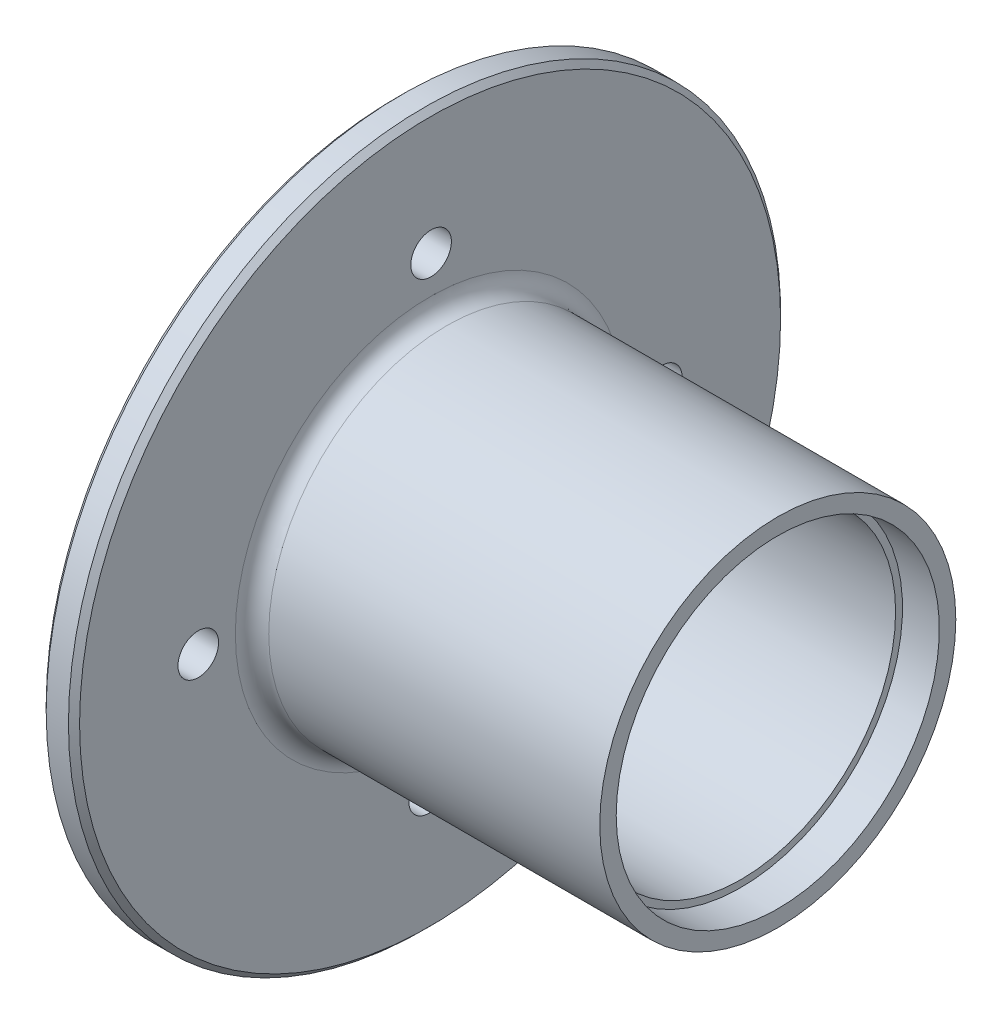
ISO-10303-21;
HEADER;
FILE_DESCRIPTION(('STEP AP214'),'2;1');
FILE_NAME('part.step','',(''),(''),'','','');
FILE_SCHEMA(('AUTOMOTIVE_DESIGN { 1 0 10303 214 1 1 1 1 }'));
ENDSEC;
DATA;
#1=APPLICATION_CONTEXT('core data for automotive mechanical design processes');
#2=APPLICATION_PROTOCOL_DEFINITION('international standard','automotive_design',2000,#1);
#3=PRODUCT_CONTEXT('',#1,'mechanical');
#4=PRODUCT('Part','Part','',(#3));
#5=PRODUCT_RELATED_PRODUCT_CATEGORY('part','',(#4));
#6=PRODUCT_DEFINITION_FORMATION('','',#4);
#7=PRODUCT_DEFINITION_CONTEXT('part definition',#1,'design');
#8=PRODUCT_DEFINITION('design','',#6,#7);
#9=PRODUCT_DEFINITION_SHAPE('','',#8);
#10=(LENGTH_UNIT() NAMED_UNIT(*) SI_UNIT(.MILLI.,.METRE.));
#11=(NAMED_UNIT(*) PLANE_ANGLE_UNIT() SI_UNIT($,.RADIAN.));
#12=(NAMED_UNIT(*) SI_UNIT($,.STERADIAN.) SOLID_ANGLE_UNIT());
#13=UNCERTAINTY_MEASURE_WITH_UNIT(LENGTH_MEASURE(1.E-05),#10,'distance_accuracy_value','');
#14=(GEOMETRIC_REPRESENTATION_CONTEXT(3) GLOBAL_UNCERTAINTY_ASSIGNED_CONTEXT((#13)) GLOBAL_UNIT_ASSIGNED_CONTEXT((#10,
#11,#12)) REPRESENTATION_CONTEXT('',''));
#15=CARTESIAN_POINT('',(0.,0.,0.));
#16=DIRECTION('',(0.,0.,1.));
#17=DIRECTION('',(1.,0.,0.));
#18=AXIS2_PLACEMENT_3D('',#15,#16,#17);
#19=CARTESIAN_POINT('',(0.,0.,0.));
#20=DIRECTION('',(-1.,0.,0.));
#21=DIRECTION('',(0.,0.,1.));
#22=AXIS2_PLACEMENT_3D('',#19,#20,#21);
#23=CONICAL_SURFACE('',#22,17.143351135521,0.767642261232655);
#24=CARTESIAN_POINT('',(4.7625,0.,0.));
#25=DIRECTION('',(-1.,0.,0.));
#26=DIRECTION('',(0.,0.,1.));
#27=AXIS2_PLACEMENT_3D('',#24,#25,#26);
#28=CIRCLE('',#27,12.5470426882416);
#29=CARTESIAN_POINT('',(4.7625,0.,12.5470426882416));
#30=VERTEX_POINT('',#29);
#31=EDGE_CURVE('E10',#30,#30,#28,.T.);
#32=ORIENTED_EDGE('',*,*,#31,.F.);
#33=EDGE_LOOP('',(#32));
#34=FACE_BOUND('',#33,.T.);
#35=CARTESIAN_POINT('',(0.,0.,0.));
#36=DIRECTION('',(-1.,0.,0.));
#37=DIRECTION('',(0.,0.,1.));
#38=AXIS2_PLACEMENT_3D('',#35,#36,#37);
#39=CIRCLE('',#38,17.143351135521);
#40=CARTESIAN_POINT('',(0.,0.,17.143351135521));
#41=VERTEX_POINT('',#40);
#42=EDGE_CURVE('E87',#41,#41,#39,.T.);
#43=ORIENTED_EDGE('',*,*,#42,.T.);
#44=EDGE_LOOP('',(#43));
#45=FACE_BOUND('',#44,.T.);
#46=ADVANCED_FACE('F38',(#34,#45),#23,.F.);
#47=CARTESIAN_POINT('',(4.7625,12.5470426882416,0.));
#48=DIRECTION('',(-1.,0.,0.));
#49=DIRECTION('',(0.,0.,1.));
#50=AXIS2_PLACEMENT_3D('',#47,#48,#49);
#51=PLANE('',#50);
#52=CARTESIAN_POINT('',(4.7625,0.,0.));
#53=DIRECTION('',(-1.,0.,0.));
#54=DIRECTION('',(0.,0.,1.));
#55=AXIS2_PLACEMENT_3D('',#52,#53,#54);
#56=CIRCLE('',#55,17.143351135521);
#57=CARTESIAN_POINT('',(4.7625,0.,17.143351135521));
#58=VERTEX_POINT('',#57);
#59=EDGE_CURVE('E44',#58,#58,#56,.T.);
#60=ORIENTED_EDGE('',*,*,#59,.F.);
#61=EDGE_LOOP('',(#60));
#62=FACE_BOUND('',#61,.T.);
#63=ORIENTED_EDGE('',*,*,#31,.T.);
#64=EDGE_LOOP('',(#63));
#65=FACE_BOUND('',#64,.T.);
#66=ADVANCED_FACE('F202',(#62,#65),#51,.F.);
#67=CARTESIAN_POINT('',(207.498884421243,0.,0.));
#68=DIRECTION('',(-1.,0.,0.));
#69=DIRECTION('',(0.,0.,1.));
#70=AXIS2_PLACEMENT_3D('',#67,#68,#69);
#71=CYLINDRICAL_SURFACE('',#70,17.143351135521);
#72=CARTESIAN_POINT('',(20.2028356501082,0.,0.));
#73=DIRECTION('',(-1.,0.,0.));
#74=DIRECTION('',(0.,0.,1.));
#75=AXIS2_PLACEMENT_3D('',#72,#73,#74);
#76=CIRCLE('',#75,17.143351135521);
#77=CARTESIAN_POINT('',(20.2028356501082,0.,17.143351135521));
#78=VERTEX_POINT('',#77);
#79=EDGE_CURVE('E48',#78,#78,#76,.T.);
#80=ORIENTED_EDGE('',*,*,#79,.F.);
#81=EDGE_LOOP('',(#80));
#82=FACE_BOUND('',#81,.T.);
#83=ORIENTED_EDGE('',*,*,#59,.T.);
#84=EDGE_LOOP('',(#83));
#85=FACE_BOUND('',#84,.T.);
#86=ADVANCED_FACE('F197',(#82,#85),#71,.F.);
#87=CARTESIAN_POINT('',(20.2028356501082,17.143351135521,0.));
#88=DIRECTION('',(-1.,0.,0.));
#89=DIRECTION('',(0.,0.,1.));
#90=AXIS2_PLACEMENT_3D('',#87,#88,#89);
#91=PLANE('',#90);
#92=CARTESIAN_POINT('',(20.2028356501082,0.,0.));
#93=DIRECTION('',(-1.,0.,0.));
#94=DIRECTION('',(0.,0.,1.));
#95=AXIS2_PLACEMENT_3D('',#92,#93,#94);
#96=CIRCLE('',#95,22.067968077904);
#97=CARTESIAN_POINT('',(20.2028356501082,0.,22.067968077904));
#98=VERTEX_POINT('',#97);
#99=EDGE_CURVE('E52',#98,#98,#96,.T.);
#100=ORIENTED_EDGE('',*,*,#99,.F.);
#101=EDGE_LOOP('',(#100));
#102=FACE_BOUND('',#101,.T.);
#103=ORIENTED_EDGE('',*,*,#79,.T.);
#104=EDGE_LOOP('',(#103));
#105=FACE_BOUND('',#104,.T.);
#106=ADVANCED_FACE('F191',(#102,#105),#91,.F.);
#107=CARTESIAN_POINT('',(207.498884421243,0.,0.));
#108=DIRECTION('',(-1.,0.,0.));
#109=DIRECTION('',(0.,0.,1.));
#110=AXIS2_PLACEMENT_3D('',#107,#108,#109);
#111=CYLINDRICAL_SURFACE('',#110,22.067968077904);
#112=CARTESIAN_POINT('',(49.1123998924168,0.,0.));
#113=DIRECTION('',(-1.,0.,0.));
#114=DIRECTION('',(0.,0.,1.));
#115=AXIS2_PLACEMENT_3D('',#112,#113,#114);
#116=CIRCLE('',#115,22.067968077904);
#117=CARTESIAN_POINT('',(49.1123998924168,0.,22.067968077904));
#118=VERTEX_POINT('',#117);
#119=EDGE_CURVE('E57',#118,#118,#116,.T.);
#120=ORIENTED_EDGE('',*,*,#119,.F.);
#121=EDGE_LOOP('',(#120));
#122=FACE_BOUND('',#121,.T.);
#123=ORIENTED_EDGE('',*,*,#99,.T.);
#124=EDGE_LOOP('',(#123));
#125=FACE_BOUND('',#124,.T.);
#126=ADVANCED_FACE('F185',(#122,#125),#111,.F.);
#127=CARTESIAN_POINT('',(49.1123998924168,22.067968077904,0.));
#128=DIRECTION('',(-1.,0.,0.));
#129=DIRECTION('',(0.,0.,1.));
#130=AXIS2_PLACEMENT_3D('',#127,#128,#129);
#131=PLANE('',#130);
#132=CARTESIAN_POINT('',(49.1123998924168,0.,0.));
#133=DIRECTION('',(-1.,0.,0.));
#134=DIRECTION('',(0.,0.,1.));
#135=AXIS2_PLACEMENT_3D('',#132,#133,#134);
#136=CIRCLE('',#135,23.0528912698023);
#137=CARTESIAN_POINT('',(49.1123998924168,0.,23.0528912698023));
#138=VERTEX_POINT('',#137);
#139=EDGE_CURVE('E60',#138,#138,#136,.T.);
#140=ORIENTED_EDGE('',*,*,#139,.F.);
#141=EDGE_LOOP('',(#140));
#142=FACE_BOUND('',#141,.T.);
#143=ORIENTED_EDGE('',*,*,#119,.T.);
#144=EDGE_LOOP('',(#143));
#145=FACE_BOUND('',#144,.T.);
#146=ADVANCED_FACE('F179',(#142,#145),#131,.F.);
#147=CARTESIAN_POINT('',(207.498884421243,0.,0.));
#148=DIRECTION('',(-1.,0.,0.));
#149=DIRECTION('',(0.,0.,1.));
#150=AXIS2_PLACEMENT_3D('',#147,#148,#149);
#151=CYLINDRICAL_SURFACE('',#150,23.0528912698023);
#152=CARTESIAN_POINT('',(54.3686846813072,0.,0.));
#153=DIRECTION('',(-1.,0.,0.));
#154=DIRECTION('',(0.,0.,1.));
#155=AXIS2_PLACEMENT_3D('',#152,#153,#154);
#156=CIRCLE('',#155,23.0528912698023);
#157=CARTESIAN_POINT('',(54.3686846813072,0.,23.0528912698023));
#158=VERTEX_POINT('',#157);
#159=EDGE_CURVE('E63',#158,#158,#156,.T.);
#160=ORIENTED_EDGE('',*,*,#159,.F.);
#161=EDGE_LOOP('',(#160));
#162=FACE_BOUND('',#161,.T.);
#163=ORIENTED_EDGE('',*,*,#139,.T.);
#164=EDGE_LOOP('',(#163));
#165=FACE_BOUND('',#164,.T.);
#166=ADVANCED_FACE('F173',(#162,#165),#151,.F.);
#167=CARTESIAN_POINT('',(54.3686846813072,23.0528912698023,0.));
#168=DIRECTION('',(-1.,0.,0.));
#169=DIRECTION('',(0.,0.,1.));
#170=AXIS2_PLACEMENT_3D('',#167,#168,#169);
#171=PLANE('',#170);
#172=CARTESIAN_POINT('',(54.3686846813072,0.,0.));
#173=DIRECTION('',(-1.,0.,0.));
#174=DIRECTION('',(0.,0.,1.));
#175=AXIS2_PLACEMENT_3D('',#172,#173,#174);
#176=CIRCLE('',#175,25.4);
#177=CARTESIAN_POINT('',(54.3686846813072,0.,25.4));
#178=VERTEX_POINT('',#177);
#179=EDGE_CURVE('E66',#178,#178,#176,.T.);
#180=ORIENTED_EDGE('',*,*,#179,.F.);
#181=EDGE_LOOP('',(#180));
#182=FACE_BOUND('',#181,.T.);
#183=ORIENTED_EDGE('',*,*,#159,.T.);
#184=EDGE_LOOP('',(#183));
#185=FACE_BOUND('',#184,.T.);
#186=ADVANCED_FACE('F167',(#182,#185),#171,.F.);
#187=CARTESIAN_POINT('',(207.498884421243,0.,0.));
#188=DIRECTION('',(-1.,0.,0.));
#189=DIRECTION('',(0.,0.,1.));
#190=AXIS2_PLACEMENT_3D('',#187,#188,#189);
#191=CYLINDRICAL_SURFACE('',#190,25.3999999999999);
#192=CARTESIAN_POINT('',(7.14375,0.,0.));
#193=DIRECTION('',(-1.,0.,0.));
#194=DIRECTION('',(0.,0.,1.));
#195=AXIS2_PLACEMENT_3D('',#192,#193,#194);
#196=CIRCLE('',#195,25.3999999999999);
#197=CARTESIAN_POINT('',(7.14375,0.,25.3999999999999));
#198=VERTEX_POINT('',#197);
#199=EDGE_CURVE('E69',#198,#198,#196,.T.);
#200=ORIENTED_EDGE('',*,*,#199,.F.);
#201=EDGE_LOOP('',(#200));
#202=FACE_BOUND('',#201,.T.);
#203=ORIENTED_EDGE('',*,*,#179,.T.);
#204=EDGE_LOOP('',(#203));
#205=FACE_BOUND('',#204,.T.);
#206=ADVANCED_FACE('F161',(#202,#205),#191,.T.);
#207=CARTESIAN_POINT('',(7.14375,0.,0.));
#208=DIRECTION('',(-1.,0.,0.));
#209=DIRECTION('',(0.,0.,1.));
#210=AXIS2_PLACEMENT_3D('',#207,#208,#209);
#211=TOROIDAL_SURFACE('',#210,27.7812499999999,2.38125);
#212=CARTESIAN_POINT('',(4.7625,0.,0.));
#213=DIRECTION('',(-1.,0.,0.));
#214=DIRECTION('',(0.,0.,1.));
#215=AXIS2_PLACEMENT_3D('',#212,#213,#214);
#216=CIRCLE('',#215,27.7812499999999);
#217=CARTESIAN_POINT('',(4.7625,0.,27.7812499999999));
#218=VERTEX_POINT('',#217);
#219=EDGE_CURVE('E72',#218,#218,#216,.T.);
#220=ORIENTED_EDGE('',*,*,#219,.F.);
#221=EDGE_LOOP('',(#220));
#222=FACE_BOUND('',#221,.T.);
#223=ORIENTED_EDGE('',*,*,#199,.T.);
#224=EDGE_LOOP('',(#223));
#225=FACE_BOUND('',#224,.T.);
#226=ADVANCED_FACE('F154',(#222,#225),#211,.F.);
#227=CARTESIAN_POINT('',(4.7625,27.7812499999999,0.));
#228=DIRECTION('',(-1.,0.,0.));
#229=DIRECTION('',(0.,0.,1.));
#230=AXIS2_PLACEMENT_3D('',#227,#228,#229);
#231=PLANE('',#230);
#232=CARTESIAN_POINT('',(4.7625,0.14697334332829,33.069002248787));
#233=DIRECTION('',(-1.,0.,0.));
#234=DIRECTION('',(0.,0.,1.));
#235=AXIS2_PLACEMENT_3D('',#232,#233,#234);
#236=CIRCLE('',#235,2.89559999999999);
#237=CARTESIAN_POINT('',(4.7625,0.14697334332829,35.964602248787));
#238=VERTEX_POINT('',#237);
#239=EDGE_CURVE('E108',#238,#238,#236,.T.);
#240=ORIENTED_EDGE('',*,*,#239,.T.);
#241=EDGE_LOOP('',(#240));
#242=FACE_BOUND('',#241,.T.);
#243=CARTESIAN_POINT('',(4.7625,-33.069002248787,0.146973343328175));
#244=DIRECTION('',(-1.,0.,0.));
#245=DIRECTION('',(0.,0.,1.));
#246=AXIS2_PLACEMENT_3D('',#243,#244,#245);
#247=CIRCLE('',#246,2.89559999999999);
#248=CARTESIAN_POINT('',(4.7625,-33.069002248787,3.04257334332816));
#249=VERTEX_POINT('',#248);
#250=EDGE_CURVE('E102',#249,#249,#247,.T.);
#251=ORIENTED_EDGE('',*,*,#250,.T.);
#252=EDGE_LOOP('',(#251));
#253=FACE_BOUND('',#252,.T.);
#254=CARTESIAN_POINT('',(4.7625,-0.14697334332806,-33.069002248787));
#255=DIRECTION('',(-1.,0.,0.));
#256=DIRECTION('',(0.,0.,1.));
#257=AXIS2_PLACEMENT_3D('',#254,#255,#256);
#258=CIRCLE('',#257,2.89559999999999);
#259=CARTESIAN_POINT('',(4.7625,-0.14697334332806,-30.173402248787));
#260=VERTEX_POINT('',#259);
#261=EDGE_CURVE('E96',#260,#260,#258,.T.);
#262=ORIENTED_EDGE('',*,*,#261,.T.);
#263=EDGE_LOOP('',(#262));
#264=FACE_BOUND('',#263,.T.);
#265=CARTESIAN_POINT('',(4.7625,33.069002248787,-0.146973343327944));
#266=DIRECTION('',(-1.,0.,0.));
#267=DIRECTION('',(0.,0.,1.));
#268=AXIS2_PLACEMENT_3D('',#265,#266,#267);
#269=CIRCLE('',#268,2.89559999999999);
#270=CARTESIAN_POINT('',(4.7625,33.069002248787,2.74862665667205));
#271=VERTEX_POINT('',#270);
#272=EDGE_CURVE('E90',#271,#271,#269,.T.);
#273=ORIENTED_EDGE('',*,*,#272,.T.);
#274=EDGE_LOOP('',(#273));
#275=FACE_BOUND('',#274,.T.);
#276=CARTESIAN_POINT('',(4.7625,0.,0.));
#277=DIRECTION('',(-1.,0.,0.));
#278=DIRECTION('',(0.,0.,1.));
#279=AXIS2_PLACEMENT_3D('',#276,#277,#278);
#280=CIRCLE('',#279,50.00625);
#281=CARTESIAN_POINT('',(4.7625,0.,50.00625));
#282=VERTEX_POINT('',#281);
#283=EDGE_CURVE('E75',#282,#282,#280,.T.);
#284=ORIENTED_EDGE('',*,*,#283,.F.);
#285=EDGE_LOOP('',(#284));
#286=FACE_BOUND('',#285,.T.);
#287=ORIENTED_EDGE('',*,*,#219,.T.);
#288=EDGE_LOOP('',(#287));
#289=FACE_BOUND('',#288,.T.);
#290=ADVANCED_FACE('F148',(#242,#253,#264,#275,#286,#289),#231,.F.);
#291=CARTESIAN_POINT('',(4.7625,0.,0.));
#292=DIRECTION('',(-1.,0.,0.));
#293=DIRECTION('',(0.,0.,1.));
#294=AXIS2_PLACEMENT_3D('',#291,#292,#293);
#295=CONICAL_SURFACE('',#294,50.00625,0.785398163397431);
#296=CARTESIAN_POINT('',(3.96874999999999,0.,0.));
#297=DIRECTION('',(-1.,0.,0.));
#298=DIRECTION('',(0.,0.,1.));
#299=AXIS2_PLACEMENT_3D('',#296,#297,#298);
#300=CIRCLE('',#299,50.8);
#301=CARTESIAN_POINT('',(3.96874999999999,0.,50.8));
#302=VERTEX_POINT('',#301);
#303=EDGE_CURVE('E78',#302,#302,#300,.T.);
#304=ORIENTED_EDGE('',*,*,#303,.F.);
#305=EDGE_LOOP('',(#304));
#306=FACE_BOUND('',#305,.T.);
#307=ORIENTED_EDGE('',*,*,#283,.T.);
#308=EDGE_LOOP('',(#307));
#309=FACE_BOUND('',#308,.T.);
#310=ADVANCED_FACE('F142',(#306,#309),#295,.T.);
#311=CARTESIAN_POINT('',(207.498884421243,0.,0.));
#312=DIRECTION('',(-1.,0.,0.));
#313=DIRECTION('',(0.,0.,1.));
#314=AXIS2_PLACEMENT_3D('',#311,#312,#313);
#315=CYLINDRICAL_SURFACE('',#314,50.8);
#316=CARTESIAN_POINT('',(0.79375000000001,0.,0.));
#317=DIRECTION('',(-1.,0.,0.));
#318=DIRECTION('',(0.,0.,1.));
#319=AXIS2_PLACEMENT_3D('',#316,#317,#318);
#320=CIRCLE('',#319,50.8);
#321=CARTESIAN_POINT('',(0.79375000000001,0.,50.8));
#322=VERTEX_POINT('',#321);
#323=EDGE_CURVE('E81',#322,#322,#320,.T.);
#324=ORIENTED_EDGE('',*,*,#323,.F.);
#325=EDGE_LOOP('',(#324));
#326=FACE_BOUND('',#325,.T.);
#327=ORIENTED_EDGE('',*,*,#303,.T.);
#328=EDGE_LOOP('',(#327));
#329=FACE_BOUND('',#328,.T.);
#330=ADVANCED_FACE('F136',(#326,#329),#315,.T.);
#331=CARTESIAN_POINT('',(0.79375000000001,0.,0.));
#332=DIRECTION('',(1.,0.,0.));
#333=DIRECTION('',(0.,0.,-1.));
#334=AXIS2_PLACEMENT_3D('',#331,#332,#333);
#335=CONICAL_SURFACE('',#334,50.8,0.785398163397431);
#336=CARTESIAN_POINT('',(0.,0.,0.));
#337=DIRECTION('',(-1.,0.,0.));
#338=DIRECTION('',(0.,0.,1.));
#339=AXIS2_PLACEMENT_3D('',#336,#337,#338);
#340=CIRCLE('',#339,50.00625);
#341=CARTESIAN_POINT('',(0.,0.,50.00625));
#342=VERTEX_POINT('',#341);
#343=EDGE_CURVE('E84',#342,#342,#340,.T.);
#344=ORIENTED_EDGE('',*,*,#343,.F.);
#345=EDGE_LOOP('',(#344));
#346=FACE_BOUND('',#345,.T.);
#347=ORIENTED_EDGE('',*,*,#323,.T.);
#348=EDGE_LOOP('',(#347));
#349=FACE_BOUND('',#348,.T.);
#350=ADVANCED_FACE('F122',(#346,#349),#335,.T.);
#351=CARTESIAN_POINT('',(0.,50.00625,0.));
#352=DIRECTION('',(1.,0.,0.));
#353=DIRECTION('',(0.,0.,-1.));
#354=AXIS2_PLACEMENT_3D('',#351,#352,#353);
#355=PLANE('',#354);
#356=CARTESIAN_POINT('',(0.,0.14697334332829,33.069002248787));
#357=DIRECTION('',(-1.,0.,0.));
#358=DIRECTION('',(0.,0.,1.));
#359=AXIS2_PLACEMENT_3D('',#356,#357,#358);
#360=CIRCLE('',#359,2.89559999999999);
#361=CARTESIAN_POINT('',(0.,0.14697334332829,35.964602248787));
#362=VERTEX_POINT('',#361);
#363=EDGE_CURVE('E111',#362,#362,#360,.T.);
#364=ORIENTED_EDGE('',*,*,#363,.F.);
#365=EDGE_LOOP('',(#364));
#366=FACE_BOUND('',#365,.T.);
#367=CARTESIAN_POINT('',(0.,-33.069002248787,0.146973343328175));
#368=DIRECTION('',(-1.,0.,0.));
#369=DIRECTION('',(0.,0.,1.));
#370=AXIS2_PLACEMENT_3D('',#367,#368,#369);
#371=CIRCLE('',#370,2.89559999999999);
#372=CARTESIAN_POINT('',(0.,-33.069002248787,3.04257334332816));
#373=VERTEX_POINT('',#372);
#374=EDGE_CURVE('E105',#373,#373,#371,.T.);
#375=ORIENTED_EDGE('',*,*,#374,.F.);
#376=EDGE_LOOP('',(#375));
#377=FACE_BOUND('',#376,.T.);
#378=CARTESIAN_POINT('',(0.,-0.14697334332806,-33.069002248787));
#379=DIRECTION('',(-1.,0.,0.));
#380=DIRECTION('',(0.,0.,1.));
#381=AXIS2_PLACEMENT_3D('',#378,#379,#380);
#382=CIRCLE('',#381,2.89559999999999);
#383=CARTESIAN_POINT('',(0.,-0.14697334332806,-30.173402248787));
#384=VERTEX_POINT('',#383);
#385=EDGE_CURVE('E99',#384,#384,#382,.T.);
#386=ORIENTED_EDGE('',*,*,#385,.F.);
#387=EDGE_LOOP('',(#386));
#388=FACE_BOUND('',#387,.T.);
#389=CARTESIAN_POINT('',(0.,33.069002248787,-0.146973343327944));
#390=DIRECTION('',(-1.,0.,0.));
#391=DIRECTION('',(0.,0.,1.));
#392=AXIS2_PLACEMENT_3D('',#389,#390,#391);
#393=CIRCLE('',#392,2.89559999999999);
#394=CARTESIAN_POINT('',(0.,33.069002248787,2.74862665667205));
#395=VERTEX_POINT('',#394);
#396=EDGE_CURVE('E93',#395,#395,#393,.T.);
#397=ORIENTED_EDGE('',*,*,#396,.F.);
#398=EDGE_LOOP('',(#397));
#399=FACE_BOUND('',#398,.T.);
#400=ORIENTED_EDGE('',*,*,#42,.F.);
#401=EDGE_LOOP('',(#400));
#402=FACE_BOUND('',#401,.T.);
#403=ORIENTED_EDGE('',*,*,#343,.T.);
#404=EDGE_LOOP('',(#403));
#405=FACE_BOUND('',#404,.T.);
#406=ADVANCED_FACE('F118',(#366,#377,#388,#399,#402,#405),#355,.F.);
#407=CARTESIAN_POINT('',(0.,33.069002248787,-0.146973343327944));
#408=DIRECTION('',(-1.,0.,0.));
#409=DIRECTION('',(0.,0.,1.));
#410=AXIS2_PLACEMENT_3D('',#407,#408,#409);
#411=CYLINDRICAL_SURFACE('',#410,2.89559999999999);
#412=ORIENTED_EDGE('',*,*,#396,.T.);
#413=EDGE_LOOP('',(#412));
#414=FACE_BOUND('',#413,.T.);
#415=ORIENTED_EDGE('',*,*,#272,.F.);
#416=EDGE_LOOP('',(#415));
#417=FACE_BOUND('',#416,.T.);
#418=ADVANCED_FACE('F121',(#414,#417),#411,.F.);
#419=CARTESIAN_POINT('',(0.,-0.14697334332806,-33.069002248787));
#420=DIRECTION('',(-1.,0.,0.));
#421=DIRECTION('',(0.,0.,1.));
#422=AXIS2_PLACEMENT_3D('',#419,#420,#421);
#423=CYLINDRICAL_SURFACE('',#422,2.89559999999999);
#424=ORIENTED_EDGE('',*,*,#385,.T.);
#425=EDGE_LOOP('',(#424));
#426=FACE_BOUND('',#425,.T.);
#427=ORIENTED_EDGE('',*,*,#261,.F.);
#428=EDGE_LOOP('',(#427));
#429=FACE_BOUND('',#428,.T.);
#430=ADVANCED_FACE('F303',(#426,#429),#423,.F.);
#431=CARTESIAN_POINT('',(0.,-33.069002248787,0.146973343328175));
#432=DIRECTION('',(-1.,0.,0.));
#433=DIRECTION('',(0.,0.,1.));
#434=AXIS2_PLACEMENT_3D('',#431,#432,#433);
#435=CYLINDRICAL_SURFACE('',#434,2.89559999999999);
#436=ORIENTED_EDGE('',*,*,#374,.T.);
#437=EDGE_LOOP('',(#436));
#438=FACE_BOUND('',#437,.T.);
#439=ORIENTED_EDGE('',*,*,#250,.F.);
#440=EDGE_LOOP('',(#439));
#441=FACE_BOUND('',#440,.T.);
#442=ADVANCED_FACE('F312',(#438,#441),#435,.F.);
#443=CARTESIAN_POINT('',(0.,0.14697334332829,33.069002248787));
#444=DIRECTION('',(-1.,0.,0.));
#445=DIRECTION('',(0.,0.,1.));
#446=AXIS2_PLACEMENT_3D('',#443,#444,#445);
#447=CYLINDRICAL_SURFACE('',#446,2.89559999999999);
#448=ORIENTED_EDGE('',*,*,#363,.T.);
#449=EDGE_LOOP('',(#448));
#450=FACE_BOUND('',#449,.T.);
#451=ORIENTED_EDGE('',*,*,#239,.F.);
#452=EDGE_LOOP('',(#451));
#453=FACE_BOUND('',#452,.T.);
#454=ADVANCED_FACE('F115',(#450,#453),#447,.F.);
#455=CLOSED_SHELL('',(#46,#66,#86,#106,#126,#146,#166,#186,#206,#226,#290,#310,#330,#350,#406,
#418,#430,#442,#454));
#456=MANIFOLD_SOLID_BREP('B2',#455);
#457=ADVANCED_BREP_SHAPE_REPRESENTATION('',(#18,#456),#14);
#458=SHAPE_DEFINITION_REPRESENTATION(#9,#457);
ENDSEC;
END-ISO-10303-21;
